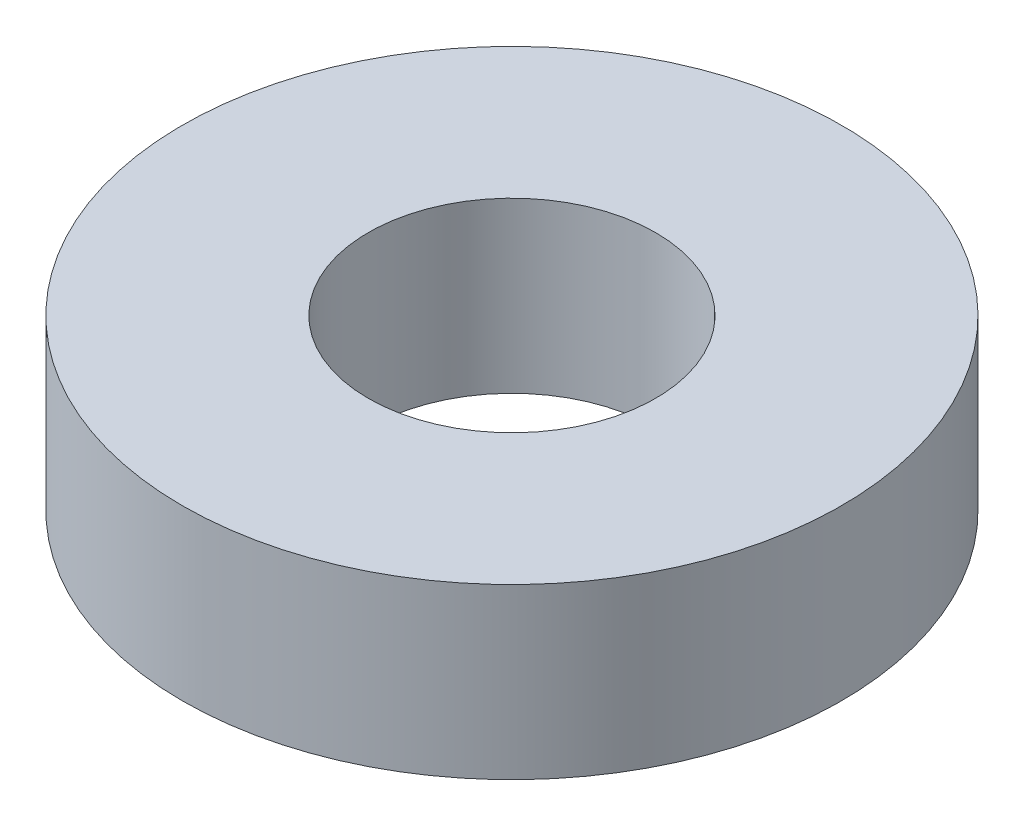
ISO-10303-21;
HEADER;
FILE_DESCRIPTION(('STEP AP214'),'2;1');
FILE_NAME('part.step','',(''),(''),'','','');
FILE_SCHEMA(('AUTOMOTIVE_DESIGN { 1 0 10303 214 1 1 1 1 }'));
ENDSEC;
DATA;
#1=APPLICATION_CONTEXT('core data for automotive mechanical design processes');
#2=APPLICATION_PROTOCOL_DEFINITION('international standard','automotive_design',2000,#1);
#3=PRODUCT_CONTEXT('',#1,'mechanical');
#4=PRODUCT('Part','Part','',(#3));
#5=PRODUCT_RELATED_PRODUCT_CATEGORY('part','',(#4));
#6=PRODUCT_DEFINITION_FORMATION('','',#4);
#7=PRODUCT_DEFINITION_CONTEXT('part definition',#1,'design');
#8=PRODUCT_DEFINITION('design','',#6,#7);
#9=PRODUCT_DEFINITION_SHAPE('','',#8);
#10=(LENGTH_UNIT() NAMED_UNIT(*) SI_UNIT(.MILLI.,.METRE.));
#11=(NAMED_UNIT(*) PLANE_ANGLE_UNIT() SI_UNIT($,.RADIAN.));
#12=(NAMED_UNIT(*) SI_UNIT($,.STERADIAN.) SOLID_ANGLE_UNIT());
#13=UNCERTAINTY_MEASURE_WITH_UNIT(LENGTH_MEASURE(1.E-05),#10,'distance_accuracy_value','');
#14=(GEOMETRIC_REPRESENTATION_CONTEXT(3) GLOBAL_UNCERTAINTY_ASSIGNED_CONTEXT((#13)) GLOBAL_UNIT_ASSIGNED_CONTEXT((#10,
#11,#12)) REPRESENTATION_CONTEXT('',''));
#15=CARTESIAN_POINT('',(0.,0.,0.));
#16=DIRECTION('',(0.,0.,1.));
#17=DIRECTION('',(1.,0.,0.));
#18=AXIS2_PLACEMENT_3D('',#15,#16,#17);
#19=CARTESIAN_POINT('',(0.,2.,0.));
#20=DIRECTION('',(0.,1.,0.));
#21=DIRECTION('',(0.,0.,1.));
#22=AXIS2_PLACEMENT_3D('',#19,#20,#21);
#23=PLANE('',#22);
#24=CARTESIAN_POINT('',(0.,2.,0.));
#25=DIRECTION('',(0.,1.,0.));
#26=DIRECTION('',(0.,0.,1.));
#27=AXIS2_PLACEMENT_3D('',#24,#25,#26);
#28=CIRCLE('',#27,3.9);
#29=CARTESIAN_POINT('',(0.,2.,3.9));
#30=VERTEX_POINT('',#29);
#31=EDGE_CURVE('E10',#30,#30,#28,.T.);
#32=ORIENTED_EDGE('',*,*,#31,.T.);
#33=EDGE_LOOP('',(#32));
#34=FACE_BOUND('',#33,.T.);
#35=CARTESIAN_POINT('',(0.,2.,0.));
#36=DIRECTION('',(0.,1.,0.));
#37=DIRECTION('',(0.,0.,1.));
#38=AXIS2_PLACEMENT_3D('',#35,#36,#37);
#39=CIRCLE('',#38,1.7);
#40=CARTESIAN_POINT('',(0.,2.,1.7));
#41=VERTEX_POINT('',#40);
#42=EDGE_CURVE('E50',#41,#41,#39,.T.);
#43=ORIENTED_EDGE('',*,*,#42,.F.);
#44=EDGE_LOOP('',(#43));
#45=FACE_BOUND('',#44,.T.);
#46=ADVANCED_FACE('F37',(#34,#45),#23,.T.);
#47=CARTESIAN_POINT('',(0.,0.,0.));
#48=DIRECTION('',(0.,1.,0.));
#49=DIRECTION('',(0.,0.,1.));
#50=AXIS2_PLACEMENT_3D('',#47,#48,#49);
#51=PLANE('',#50);
#52=CARTESIAN_POINT('',(0.,0.,0.));
#53=DIRECTION('',(0.,1.,0.));
#54=DIRECTION('',(0.,0.,1.));
#55=AXIS2_PLACEMENT_3D('',#52,#53,#54);
#56=CIRCLE('',#55,3.9);
#57=CARTESIAN_POINT('',(0.,0.,3.9));
#58=VERTEX_POINT('',#57);
#59=EDGE_CURVE('E41',#58,#58,#56,.T.);
#60=ORIENTED_EDGE('',*,*,#59,.F.);
#61=EDGE_LOOP('',(#60));
#62=FACE_BOUND('',#61,.T.);
#63=CARTESIAN_POINT('',(0.,0.,0.));
#64=DIRECTION('',(0.,1.,0.));
#65=DIRECTION('',(0.,0.,1.));
#66=AXIS2_PLACEMENT_3D('',#63,#64,#65);
#67=CIRCLE('',#66,1.7);
#68=CARTESIAN_POINT('',(0.,0.,1.7));
#69=VERTEX_POINT('',#68);
#70=EDGE_CURVE('E52',#69,#69,#67,.T.);
#71=ORIENTED_EDGE('',*,*,#70,.T.);
#72=EDGE_LOOP('',(#71));
#73=FACE_BOUND('',#72,.T.);
#74=ADVANCED_FACE('F64',(#62,#73),#51,.F.);
#75=CARTESIAN_POINT('',(0.,2.,0.));
#76=DIRECTION('',(0.,-1.,0.));
#77=DIRECTION('',(0.,0.,-1.));
#78=AXIS2_PLACEMENT_3D('',#75,#76,#77);
#79=CYLINDRICAL_SURFACE('',#78,3.9);
#80=ORIENTED_EDGE('',*,*,#31,.F.);
#81=EDGE_LOOP('',(#80));
#82=FACE_BOUND('',#81,.T.);
#83=ORIENTED_EDGE('',*,*,#59,.T.);
#84=EDGE_LOOP('',(#83));
#85=FACE_BOUND('',#84,.T.);
#86=ADVANCED_FACE('F39',(#82,#85),#79,.T.);
#87=CARTESIAN_POINT('',(0.,2.,0.));
#88=DIRECTION('',(0.,-1.,0.));
#89=DIRECTION('',(0.,0.,-1.));
#90=AXIS2_PLACEMENT_3D('',#87,#88,#89);
#91=CYLINDRICAL_SURFACE('',#90,1.7);
#92=ORIENTED_EDGE('',*,*,#42,.T.);
#93=EDGE_LOOP('',(#92));
#94=FACE_BOUND('',#93,.T.);
#95=ORIENTED_EDGE('',*,*,#70,.F.);
#96=EDGE_LOOP('',(#95));
#97=FACE_BOUND('',#96,.T.);
#98=ADVANCED_FACE('F60',(#94,#97),#91,.F.);
#99=CLOSED_SHELL('',(#46,#74,#86,#98));
#100=MANIFOLD_SOLID_BREP('B2',#99);
#101=ADVANCED_BREP_SHAPE_REPRESENTATION('',(#18,#100),#14);
#102=SHAPE_DEFINITION_REPRESENTATION(#9,#101);
ENDSEC;
END-ISO-10303-21;
